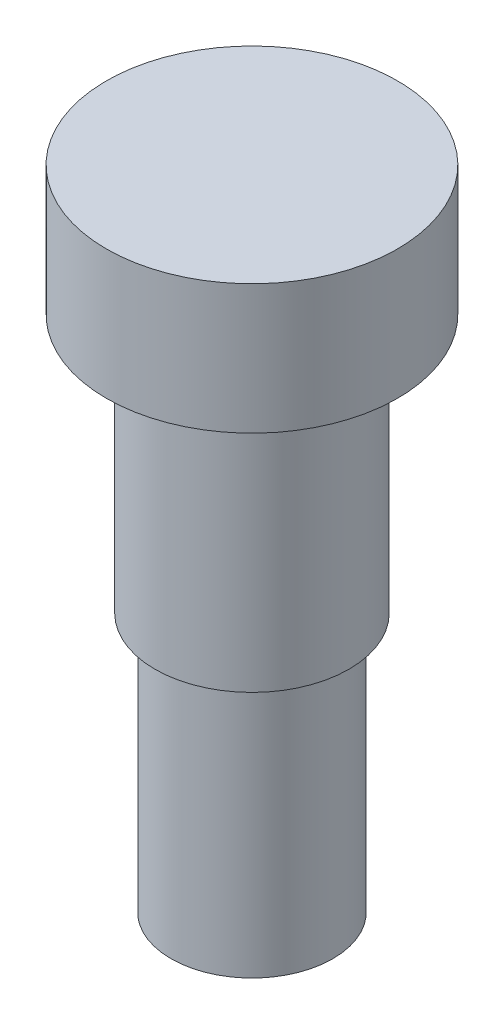
ISO-10303-21;
HEADER;
FILE_DESCRIPTION(('STEP AP214'),'2;1');
FILE_NAME('part.step','',(''),(''),'','','');
FILE_SCHEMA(('AUTOMOTIVE_DESIGN { 1 0 10303 214 1 1 1 1 }'));
ENDSEC;
DATA;
#1=APPLICATION_CONTEXT('core data for automotive mechanical design processes');
#2=APPLICATION_PROTOCOL_DEFINITION('international standard','automotive_design',2000,#1);
#3=PRODUCT_CONTEXT('',#1,'mechanical');
#4=PRODUCT('Part','Part','',(#3));
#5=PRODUCT_RELATED_PRODUCT_CATEGORY('part','',(#4));
#6=PRODUCT_DEFINITION_FORMATION('','',#4);
#7=PRODUCT_DEFINITION_CONTEXT('part definition',#1,'design');
#8=PRODUCT_DEFINITION('design','',#6,#7);
#9=PRODUCT_DEFINITION_SHAPE('','',#8);
#10=(LENGTH_UNIT() NAMED_UNIT(*) SI_UNIT(.MILLI.,.METRE.));
#11=(NAMED_UNIT(*) PLANE_ANGLE_UNIT() SI_UNIT($,.RADIAN.));
#12=(NAMED_UNIT(*) SI_UNIT($,.STERADIAN.) SOLID_ANGLE_UNIT());
#13=UNCERTAINTY_MEASURE_WITH_UNIT(LENGTH_MEASURE(1.E-05),#10,'distance_accuracy_value','');
#14=(GEOMETRIC_REPRESENTATION_CONTEXT(3) GLOBAL_UNCERTAINTY_ASSIGNED_CONTEXT((#13)) GLOBAL_UNIT_ASSIGNED_CONTEXT((#10,
#11,#12)) REPRESENTATION_CONTEXT('',''));
#15=CARTESIAN_POINT('',(0.,0.,0.));
#16=DIRECTION('',(0.,0.,1.));
#17=DIRECTION('',(1.,0.,0.));
#18=AXIS2_PLACEMENT_3D('',#15,#16,#17);
#19=CARTESIAN_POINT('',(3.96875000000001,-25.4,0.));
#20=DIRECTION('',(0.,1.,0.));
#21=DIRECTION('',(0.,0.,1.));
#22=AXIS2_PLACEMENT_3D('',#19,#20,#21);
#23=PLANE('',#22);
#24=CARTESIAN_POINT('',(0.,-25.4,0.));
#25=DIRECTION('',(0.,1.,0.));
#26=DIRECTION('',(0.,0.,1.));
#27=AXIS2_PLACEMENT_3D('',#24,#25,#26);
#28=CIRCLE('',#27,3.96875000000001);
#29=CARTESIAN_POINT('',(0.,-25.4,3.96875000000001));
#30=VERTEX_POINT('',#29);
#31=EDGE_CURVE('E10',#30,#30,#28,.T.);
#32=ORIENTED_EDGE('',*,*,#31,.F.);
#33=EDGE_LOOP('',(#32));
#34=FACE_BOUND('',#33,.T.);
#35=ADVANCED_FACE('F30',(#34),#23,.F.);
#36=CARTESIAN_POINT('',(0.,24.8323599523242,0.));
#37=DIRECTION('',(0.,1.,0.));
#38=DIRECTION('',(0.,0.,1.));
#39=AXIS2_PLACEMENT_3D('',#36,#37,#38);
#40=CYLINDRICAL_SURFACE('',#39,3.96875000000001);
#41=CARTESIAN_POINT('',(0.,-12.7,0.));
#42=DIRECTION('',(0.,1.,0.));
#43=DIRECTION('',(0.,0.,1.));
#44=AXIS2_PLACEMENT_3D('',#41,#42,#43);
#45=CIRCLE('',#44,3.96875000000001);
#46=CARTESIAN_POINT('',(0.,-12.7,3.96875000000001));
#47=VERTEX_POINT('',#46);
#48=EDGE_CURVE('E36',#47,#47,#45,.T.);
#49=ORIENTED_EDGE('',*,*,#48,.F.);
#50=EDGE_LOOP('',(#49));
#51=FACE_BOUND('',#50,.T.);
#52=ORIENTED_EDGE('',*,*,#31,.T.);
#53=EDGE_LOOP('',(#52));
#54=FACE_BOUND('',#53,.T.);
#55=ADVANCED_FACE('F78',(#51,#54),#40,.T.);
#56=CARTESIAN_POINT('',(4.7625,-12.7,0.));
#57=DIRECTION('',(0.,1.,0.));
#58=DIRECTION('',(0.,0.,1.));
#59=AXIS2_PLACEMENT_3D('',#56,#57,#58);
#60=PLANE('',#59);
#61=CARTESIAN_POINT('',(0.,-12.7,0.));
#62=DIRECTION('',(0.,1.,0.));
#63=DIRECTION('',(0.,0.,1.));
#64=AXIS2_PLACEMENT_3D('',#61,#62,#63);
#65=CIRCLE('',#64,4.7625);
#66=CARTESIAN_POINT('',(0.,-12.7,4.7625));
#67=VERTEX_POINT('',#66);
#68=EDGE_CURVE('E40',#67,#67,#65,.T.);
#69=ORIENTED_EDGE('',*,*,#68,.F.);
#70=EDGE_LOOP('',(#69));
#71=FACE_BOUND('',#70,.T.);
#72=ORIENTED_EDGE('',*,*,#48,.T.);
#73=EDGE_LOOP('',(#72));
#74=FACE_BOUND('',#73,.T.);
#75=ADVANCED_FACE('F73',(#71,#74),#60,.F.);
#76=CARTESIAN_POINT('',(0.,24.8323599523242,0.));
#77=DIRECTION('',(0.,1.,0.));
#78=DIRECTION('',(0.,0.,1.));
#79=AXIS2_PLACEMENT_3D('',#76,#77,#78);
#80=CYLINDRICAL_SURFACE('',#79,4.7625);
#81=CARTESIAN_POINT('',(0.,0.,0.));
#82=DIRECTION('',(0.,1.,0.));
#83=DIRECTION('',(0.,0.,1.));
#84=AXIS2_PLACEMENT_3D('',#81,#82,#83);
#85=CIRCLE('',#84,4.7625);
#86=CARTESIAN_POINT('',(0.,0.,4.7625));
#87=VERTEX_POINT('',#86);
#88=EDGE_CURVE('E44',#87,#87,#85,.T.);
#89=ORIENTED_EDGE('',*,*,#88,.F.);
#90=EDGE_LOOP('',(#89));
#91=FACE_BOUND('',#90,.T.);
#92=ORIENTED_EDGE('',*,*,#68,.T.);
#93=EDGE_LOOP('',(#92));
#94=FACE_BOUND('',#93,.T.);
#95=ADVANCED_FACE('F67',(#91,#94),#80,.T.);
#96=CARTESIAN_POINT('',(7.14375,0.,0.));
#97=DIRECTION('',(0.,1.,0.));
#98=DIRECTION('',(0.,0.,1.));
#99=AXIS2_PLACEMENT_3D('',#96,#97,#98);
#100=PLANE('',#99);
#101=CARTESIAN_POINT('',(0.,0.,0.));
#102=DIRECTION('',(0.,1.,0.));
#103=DIRECTION('',(0.,0.,1.));
#104=AXIS2_PLACEMENT_3D('',#101,#102,#103);
#105=CIRCLE('',#104,7.14375);
#106=CARTESIAN_POINT('',(0.,0.,7.14375));
#107=VERTEX_POINT('',#106);
#108=EDGE_CURVE('E49',#107,#107,#105,.T.);
#109=ORIENTED_EDGE('',*,*,#108,.F.);
#110=EDGE_LOOP('',(#109));
#111=FACE_BOUND('',#110,.T.);
#112=ORIENTED_EDGE('',*,*,#88,.T.);
#113=EDGE_LOOP('',(#112));
#114=FACE_BOUND('',#113,.T.);
#115=ADVANCED_FACE('F61',(#111,#114),#100,.F.);
#116=CARTESIAN_POINT('',(0.,24.8323599523242,0.));
#117=DIRECTION('',(0.,1.,0.));
#118=DIRECTION('',(0.,0.,1.));
#119=AXIS2_PLACEMENT_3D('',#116,#117,#118);
#120=CYLINDRICAL_SURFACE('',#119,7.14375);
#121=CARTESIAN_POINT('',(0.,6.35,0.));
#122=DIRECTION('',(0.,1.,0.));
#123=DIRECTION('',(0.,0.,1.));
#124=AXIS2_PLACEMENT_3D('',#121,#122,#123);
#125=CIRCLE('',#124,7.14375);
#126=CARTESIAN_POINT('',(0.,6.35,7.14375));
#127=VERTEX_POINT('',#126);
#128=EDGE_CURVE('E52',#127,#127,#125,.T.);
#129=ORIENTED_EDGE('',*,*,#128,.F.);
#130=EDGE_LOOP('',(#129));
#131=FACE_BOUND('',#130,.T.);
#132=ORIENTED_EDGE('',*,*,#108,.T.);
#133=EDGE_LOOP('',(#132));
#134=FACE_BOUND('',#133,.T.);
#135=ADVANCED_FACE('F58',(#131,#134),#120,.T.);
#136=CARTESIAN_POINT('',(0.,6.35,0.));
#137=DIRECTION('',(0.,-1.,0.));
#138=DIRECTION('',(0.,0.,-1.));
#139=AXIS2_PLACEMENT_3D('',#136,#137,#138);
#140=PLANE('',#139);
#141=ORIENTED_EDGE('',*,*,#128,.T.);
#142=EDGE_LOOP('',(#141));
#143=FACE_BOUND('',#142,.T.);
#144=ADVANCED_FACE('F56',(#143),#140,.F.);
#145=CLOSED_SHELL('',(#35,#55,#75,#95,#115,#135,#144));
#146=MANIFOLD_SOLID_BREP('B2',#145);
#147=ADVANCED_BREP_SHAPE_REPRESENTATION('',(#18,#146),#14);
#148=SHAPE_DEFINITION_REPRESENTATION(#9,#147);
ENDSEC;
END-ISO-10303-21;
